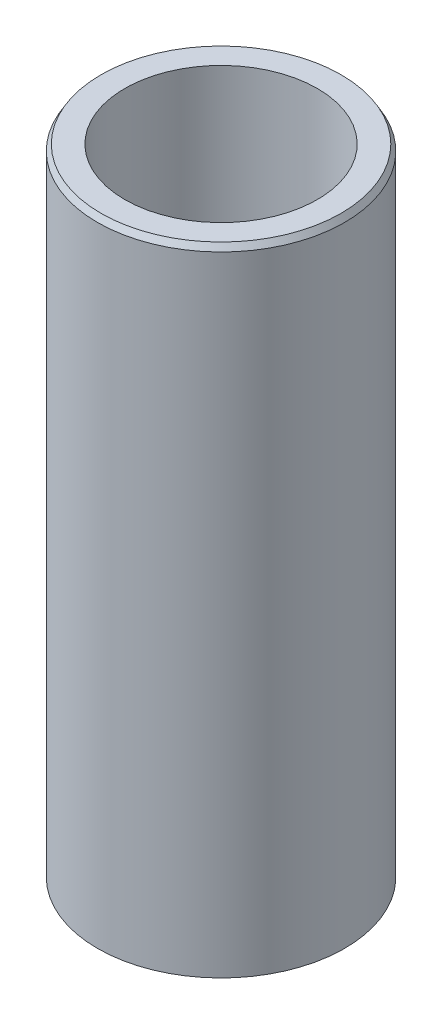
ISO-10303-21;
HEADER;
FILE_DESCRIPTION(('STEP AP214'),'2;1');
FILE_NAME('part.step','',(''),(''),'','','');
FILE_SCHEMA(('AUTOMOTIVE_DESIGN { 1 0 10303 214 1 1 1 1 }'));
ENDSEC;
DATA;
#1=APPLICATION_CONTEXT('core data for automotive mechanical design processes');
#2=APPLICATION_PROTOCOL_DEFINITION('international standard','automotive_design',2000,#1);
#3=PRODUCT_CONTEXT('',#1,'mechanical');
#4=PRODUCT('Part','Part','',(#3));
#5=PRODUCT_RELATED_PRODUCT_CATEGORY('part','',(#4));
#6=PRODUCT_DEFINITION_FORMATION('','',#4);
#7=PRODUCT_DEFINITION_CONTEXT('part definition',#1,'design');
#8=PRODUCT_DEFINITION('design','',#6,#7);
#9=PRODUCT_DEFINITION_SHAPE('','',#8);
#10=(LENGTH_UNIT() NAMED_UNIT(*) SI_UNIT(.MILLI.,.METRE.));
#11=(NAMED_UNIT(*) PLANE_ANGLE_UNIT() SI_UNIT($,.RADIAN.));
#12=(NAMED_UNIT(*) SI_UNIT($,.STERADIAN.) SOLID_ANGLE_UNIT());
#13=UNCERTAINTY_MEASURE_WITH_UNIT(LENGTH_MEASURE(1.E-05),#10,'distance_accuracy_value','');
#14=(GEOMETRIC_REPRESENTATION_CONTEXT(3) GLOBAL_UNCERTAINTY_ASSIGNED_CONTEXT((#13)) GLOBAL_UNIT_ASSIGNED_CONTEXT((#10,
#11,#12)) REPRESENTATION_CONTEXT('',''));
#15=CARTESIAN_POINT('',(0.,0.,0.));
#16=DIRECTION('',(0.,0.,1.));
#17=DIRECTION('',(1.,0.,0.));
#18=AXIS2_PLACEMENT_3D('',#15,#16,#17);
#19=CARTESIAN_POINT('',(0.,271.175712515038,0.));
#20=DIRECTION('',(0.,-1.,0.));
#21=DIRECTION('',(0.,0.,-1.));
#22=AXIS2_PLACEMENT_3D('',#19,#20,#21);
#23=CYLINDRICAL_SURFACE('',#22,52.5);
#24=CARTESIAN_POINT('',(0.,268.571954651251,0.));
#25=DIRECTION('',(0.,1.,0.));
#26=DIRECTION('',(0.,0.,1.));
#27=AXIS2_PLACEMENT_3D('',#24,#25,#26);
#28=CIRCLE('',#27,52.5);
#29=CARTESIAN_POINT('',(0.,268.571954651251,52.5));
#30=VERTEX_POINT('',#29);
#31=EDGE_CURVE('E50',#30,#30,#28,.F.);
#32=ORIENTED_EDGE('',*,*,#31,.T.);
#33=EDGE_LOOP('',(#32));
#34=FACE_BOUND('',#33,.T.);
#35=CARTESIAN_POINT('',(0.,1.50328030356184,0.));
#36=DIRECTION('',(0.,1.,0.));
#37=DIRECTION('',(0.,0.,1.));
#38=AXIS2_PLACEMENT_3D('',#35,#36,#37);
#39=CIRCLE('',#38,52.5);
#40=CARTESIAN_POINT('',(0.,1.50328030356184,52.5));
#41=VERTEX_POINT('',#40);
#42=EDGE_CURVE('E51',#41,#41,#39,.T.);
#43=ORIENTED_EDGE('',*,*,#42,.T.);
#44=EDGE_LOOP('',(#43));
#45=FACE_BOUND('',#44,.T.);
#46=ADVANCED_FACE('F39',(#34,#45),#23,.T.);
#47=CARTESIAN_POINT('',(0.,271.175712515038,0.));
#48=DIRECTION('',(0.,1.,0.));
#49=DIRECTION('',(0.,0.,1.));
#50=AXIS2_PLACEMENT_3D('',#47,#48,#49);
#51=PLANE('',#50);
#52=CARTESIAN_POINT('',(0.,271.175712515038,0.));
#53=DIRECTION('',(0.,1.,0.));
#54=DIRECTION('',(0.,0.,1.));
#55=AXIS2_PLACEMENT_3D('',#52,#53,#54);
#56=CIRCLE('',#55,50.9967196964381);
#57=CARTESIAN_POINT('',(0.,271.175712515038,50.9967196964381));
#58=VERTEX_POINT('',#57);
#59=EDGE_CURVE('E54',#58,#58,#56,.T.);
#60=ORIENTED_EDGE('',*,*,#59,.T.);
#61=EDGE_LOOP('',(#60));
#62=FACE_BOUND('',#61,.T.);
#63=CARTESIAN_POINT('',(0.,271.175712515038,0.));
#64=DIRECTION('',(0.,1.,0.));
#65=DIRECTION('',(0.,0.,1.));
#66=AXIS2_PLACEMENT_3D('',#63,#64,#65);
#67=CIRCLE('',#66,40.8970521471294);
#68=CARTESIAN_POINT('',(0.,271.175712515038,40.8970521471294));
#69=VERTEX_POINT('',#68);
#70=EDGE_CURVE('E58',#69,#69,#67,.T.);
#71=ORIENTED_EDGE('',*,*,#70,.F.);
#72=EDGE_LOOP('',(#71));
#73=FACE_BOUND('',#72,.T.);
#74=ADVANCED_FACE('F69',(#62,#73),#51,.T.);
#75=CARTESIAN_POINT('',(0.,0.,0.));
#76=DIRECTION('',(0.,1.,0.));
#77=DIRECTION('',(0.,0.,1.));
#78=AXIS2_PLACEMENT_3D('',#75,#76,#77);
#79=PLANE('',#78);
#80=CARTESIAN_POINT('',(0.,0.,0.));
#81=DIRECTION('',(0.,1.,0.));
#82=DIRECTION('',(0.,0.,1.));
#83=AXIS2_PLACEMENT_3D('',#80,#81,#82);
#84=CIRCLE('',#83,49.8962421362133);
#85=CARTESIAN_POINT('',(0.,0.,49.8962421362133));
#86=VERTEX_POINT('',#85);
#87=EDGE_CURVE('E10',#86,#86,#84,.F.);
#88=ORIENTED_EDGE('',*,*,#87,.T.);
#89=EDGE_LOOP('',(#88));
#90=FACE_BOUND('',#89,.T.);
#91=CARTESIAN_POINT('',(0.,0.,0.));
#92=DIRECTION('',(0.,1.,0.));
#93=DIRECTION('',(0.,0.,1.));
#94=AXIS2_PLACEMENT_3D('',#91,#92,#93);
#95=CIRCLE('',#94,40.8970521471294);
#96=CARTESIAN_POINT('',(0.,0.,40.8970521471294));
#97=VERTEX_POINT('',#96);
#98=EDGE_CURVE('E63',#97,#97,#95,.T.);
#99=ORIENTED_EDGE('',*,*,#98,.T.);
#100=EDGE_LOOP('',(#99));
#101=FACE_BOUND('',#100,.T.);
#102=ADVANCED_FACE('F75',(#90,#101),#79,.F.);
#103=CARTESIAN_POINT('',(0.,271.175712515038,0.));
#104=DIRECTION('',(0.,-1.,0.));
#105=DIRECTION('',(0.,0.,-1.));
#106=AXIS2_PLACEMENT_3D('',#103,#104,#105);
#107=CYLINDRICAL_SURFACE('',#106,40.8970521471294);
#108=ORIENTED_EDGE('',*,*,#70,.T.);
#109=EDGE_LOOP('',(#108));
#110=FACE_BOUND('',#109,.T.);
#111=ORIENTED_EDGE('',*,*,#98,.F.);
#112=EDGE_LOOP('',(#111));
#113=FACE_BOUND('',#112,.T.);
#114=ADVANCED_FACE('F70',(#110,#113),#107,.F.);
#115=CARTESIAN_POINT('',(0.,271.175712515038,0.));
#116=DIRECTION('',(0.,-1.,0.));
#117=DIRECTION('',(0.,0.,-1.));
#118=AXIS2_PLACEMENT_3D('',#115,#116,#117);
#119=CONICAL_SURFACE('',#118,50.9967196964381,0.523598775598305);
#120=ORIENTED_EDGE('',*,*,#31,.F.);
#121=EDGE_LOOP('',(#120));
#122=FACE_BOUND('',#121,.T.);
#123=ORIENTED_EDGE('',*,*,#59,.F.);
#124=EDGE_LOOP('',(#123));
#125=FACE_BOUND('',#124,.T.);
#126=ADVANCED_FACE('F81',(#122,#125),#119,.T.);
#127=CARTESIAN_POINT('',(0.,1.50328030356184,0.));
#128=DIRECTION('',(0.,1.,0.));
#129=DIRECTION('',(0.,0.,1.));
#130=AXIS2_PLACEMENT_3D('',#127,#128,#129);
#131=CONICAL_SURFACE('',#130,52.5,1.04719755119661);
#132=ORIENTED_EDGE('',*,*,#87,.F.);
#133=EDGE_LOOP('',(#132));
#134=FACE_BOUND('',#133,.T.);
#135=ORIENTED_EDGE('',*,*,#42,.F.);
#136=EDGE_LOOP('',(#135));
#137=FACE_BOUND('',#136,.T.);
#138=ADVANCED_FACE('F45',(#134,#137),#131,.T.);
#139=CLOSED_SHELL('',(#46,#74,#102,#114,#126,#138));
#140=MANIFOLD_SOLID_BREP('B2',#139);
#141=ADVANCED_BREP_SHAPE_REPRESENTATION('',(#18,#140),#14);
#142=SHAPE_DEFINITION_REPRESENTATION(#9,#141);
ENDSEC;
END-ISO-10303-21;
